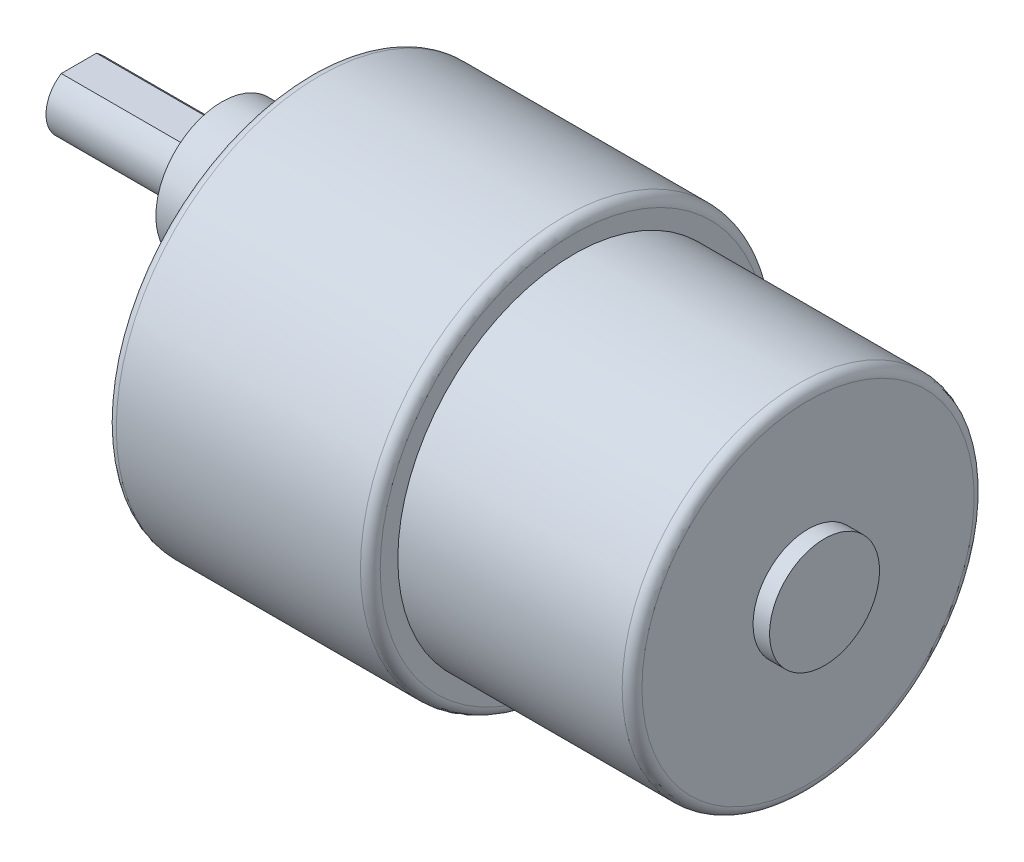
ISO-10303-21;
HEADER;
FILE_DESCRIPTION(('STEP AP214'),'2;1');
FILE_NAME('part.step','',(''),(''),'','','');
FILE_SCHEMA(('AUTOMOTIVE_DESIGN { 1 0 10303 214 1 1 1 1 }'));
ENDSEC;
DATA;
#1=APPLICATION_CONTEXT('core data for automotive mechanical design processes');
#2=APPLICATION_PROTOCOL_DEFINITION('international standard','automotive_design',2000,#1);
#3=PRODUCT_CONTEXT('',#1,'mechanical');
#4=PRODUCT('Part','Part','',(#3));
#5=PRODUCT_RELATED_PRODUCT_CATEGORY('part','',(#4));
#6=PRODUCT_DEFINITION_FORMATION('','',#4);
#7=PRODUCT_DEFINITION_CONTEXT('part definition',#1,'design');
#8=PRODUCT_DEFINITION('design','',#6,#7);
#9=PRODUCT_DEFINITION_SHAPE('','',#8);
#10=(LENGTH_UNIT() NAMED_UNIT(*) SI_UNIT(.MILLI.,.METRE.));
#11=(NAMED_UNIT(*) PLANE_ANGLE_UNIT() SI_UNIT($,.RADIAN.));
#12=(NAMED_UNIT(*) SI_UNIT($,.STERADIAN.) SOLID_ANGLE_UNIT());
#13=UNCERTAINTY_MEASURE_WITH_UNIT(LENGTH_MEASURE(1.E-05),#10,'distance_accuracy_value','');
#14=(GEOMETRIC_REPRESENTATION_CONTEXT(3) GLOBAL_UNCERTAINTY_ASSIGNED_CONTEXT((#13)) GLOBAL_UNIT_ASSIGNED_CONTEXT((#10,
#11,#12)) REPRESENTATION_CONTEXT('',''));
#15=CARTESIAN_POINT('',(0.,0.,0.));
#16=DIRECTION('',(0.,0.,1.));
#17=DIRECTION('',(1.,0.,0.));
#18=AXIS2_PLACEMENT_3D('',#15,#16,#17);
#19=CARTESIAN_POINT('',(-23.3,0.,0.));
#20=DIRECTION('',(1.,0.,0.));
#21=DIRECTION('',(0.,0.,-1.));
#22=AXIS2_PLACEMENT_3D('',#19,#20,#21);
#23=PLANE('',#22);
#24=CARTESIAN_POINT('',(-23.3,-13.4233937586587,7.75000000000016));
#25=DIRECTION('',(-1.,0.,0.));
#26=DIRECTION('',(0.,-0.866025403784433,0.50000000000001));
#27=AXIS2_PLACEMENT_3D('',#24,#25,#26);
#28=CIRCLE('',#27,0.749999999999973);
#29=CARTESIAN_POINT('',(-23.3,-14.072912811497,8.12500000000015));
#30=VERTEX_POINT('',#29);
#31=EDGE_CURVE('E274',#30,#30,#28,.T.);
#32=ORIENTED_EDGE('',*,*,#31,.F.);
#33=EDGE_LOOP('',(#32));
#34=FACE_BOUND('',#33,.T.);
#35=CARTESIAN_POINT('',(-23.3,-13.4233937586589,-7.74999999999987));
#36=DIRECTION('',(-1.,0.,0.));
#37=DIRECTION('',(0.,-0.866025403784443,-0.499999999999992));
#38=AXIS2_PLACEMENT_3D('',#35,#36,#37);
#39=CIRCLE('',#38,0.749999999999973);
#40=CARTESIAN_POINT('',(-23.3,-14.0729128114972,-8.12499999999986));
#41=VERTEX_POINT('',#40);
#42=EDGE_CURVE('E273',#41,#41,#39,.T.);
#43=ORIENTED_EDGE('',*,*,#42,.F.);
#44=EDGE_LOOP('',(#43));
#45=FACE_BOUND('',#44,.T.);
#46=CARTESIAN_POINT('',(-23.3,0.,-15.5));
#47=DIRECTION('',(-1.,0.,0.));
#48=DIRECTION('',(0.,0.,-1.));
#49=AXIS2_PLACEMENT_3D('',#46,#47,#48);
#50=CIRCLE('',#49,0.749999999999973);
#51=CARTESIAN_POINT('',(-23.3,0.,-16.25));
#52=VERTEX_POINT('',#51);
#53=EDGE_CURVE('E283',#52,#52,#50,.T.);
#54=ORIENTED_EDGE('',*,*,#53,.F.);
#55=EDGE_LOOP('',(#54));
#56=FACE_BOUND('',#55,.T.);
#57=CARTESIAN_POINT('',(-23.3,13.4233937586588,-7.75000000000006));
#58=DIRECTION('',(-1.,0.,0.));
#59=DIRECTION('',(0.,0.866025403784436,-0.500000000000004));
#60=AXIS2_PLACEMENT_3D('',#57,#58,#59);
#61=CIRCLE('',#60,0.749999999999973);
#62=CARTESIAN_POINT('',(-23.3,14.0729128114971,-8.12500000000005));
#63=VERTEX_POINT('',#62);
#64=EDGE_CURVE('E288',#63,#63,#61,.T.);
#65=ORIENTED_EDGE('',*,*,#64,.F.);
#66=EDGE_LOOP('',(#65));
#67=FACE_BOUND('',#66,.T.);
#68=CARTESIAN_POINT('',(-23.3,13.4233937586588,7.74999999999997));
#69=DIRECTION('',(-1.,0.,0.));
#70=DIRECTION('',(0.,0.86602540378444,0.499999999999998));
#71=AXIS2_PLACEMENT_3D('',#68,#69,#70);
#72=CIRCLE('',#71,0.749999999999973);
#73=CARTESIAN_POINT('',(-23.3,14.0729128114971,8.12499999999995));
#74=VERTEX_POINT('',#73);
#75=EDGE_CURVE('E294',#74,#74,#72,.T.);
#76=ORIENTED_EDGE('',*,*,#75,.F.);
#77=EDGE_LOOP('',(#76));
#78=FACE_BOUND('',#77,.T.);
#79=CARTESIAN_POINT('',(-23.3,0.,15.5));
#80=DIRECTION('',(-1.,0.,0.));
#81=DIRECTION('',(0.,0.,1.));
#82=AXIS2_PLACEMENT_3D('',#79,#80,#81);
#83=CIRCLE('',#82,0.749999999999973);
#84=CARTESIAN_POINT('',(-23.3,0.,16.25));
#85=VERTEX_POINT('',#84);
#86=EDGE_CURVE('E300',#85,#85,#83,.T.);
#87=ORIENTED_EDGE('',*,*,#86,.F.);
#88=EDGE_LOOP('',(#87));
#89=FACE_BOUND('',#88,.T.);
#90=CARTESIAN_POINT('',(-23.3,6.,0.));
#91=DIRECTION('',(1.,0.,0.));
#92=DIRECTION('',(0.,0.,-1.));
#93=AXIS2_PLACEMENT_3D('',#90,#91,#92);
#94=CIRCLE('',#93,6.);
#95=CARTESIAN_POINT('',(-23.3,6.,-6.));
#96=VERTEX_POINT('',#95);
#97=EDGE_CURVE('E11',#96,#96,#94,.F.);
#98=ORIENTED_EDGE('',*,*,#97,.F.);
#99=EDGE_LOOP('',(#98));
#100=FACE_BOUND('',#99,.T.);
#101=CARTESIAN_POINT('',(-23.3,0.,0.));
#102=DIRECTION('',(-1.,0.,0.));
#103=DIRECTION('',(0.,0.,1.));
#104=AXIS2_PLACEMENT_3D('',#101,#102,#103);
#105=CIRCLE('',#104,17.6);
#106=CARTESIAN_POINT('',(-23.3,0.,17.6));
#107=VERTEX_POINT('',#106);
#108=EDGE_CURVE('E132',#107,#107,#105,.T.);
#109=ORIENTED_EDGE('',*,*,#108,.T.);
#110=EDGE_LOOP('',(#109));
#111=FACE_BOUND('',#110,.T.);
#112=CARTESIAN_POINT('',(-23.3,6.,0.));
#113=DIRECTION('',(1.,0.,0.));
#114=DIRECTION('',(0.,0.,1.));
#115=AXIS2_PLACEMENT_3D('',#112,#113,#114);
#116=CIRCLE('',#115,8.);
#117=CARTESIAN_POINT('',(-23.3,9.66666666666667,7.11024300256718));
#118=VERTEX_POINT('',#117);
#119=CARTESIAN_POINT('',(-23.3,9.66666666666667,-7.11024300256718));
#120=VERTEX_POINT('',#119);
#121=EDGE_CURVE('E87',#118,#120,#116,.T.);
#122=ORIENTED_EDGE('',*,*,#121,.F.);
#123=CARTESIAN_POINT('',(-23.3,0.,0.));
#124=DIRECTION('',(-1.,0.,0.));
#125=DIRECTION('',(0.,0.,1.));
#126=AXIS2_PLACEMENT_3D('',#123,#124,#125);
#127=CIRCLE('',#126,12.);
#128=EDGE_CURVE('E48',#120,#118,#127,.T.);
#129=ORIENTED_EDGE('',*,*,#128,.F.);
#130=EDGE_LOOP('',(#122,#129));
#131=FACE_BOUND('',#130,.T.);
#132=ADVANCED_FACE('F33',(#34,#45,#56,#67,#78,#89,#100,#111,#131),#23,.F.);
#133=CARTESIAN_POINT('',(21.1,0.,0.));
#134=DIRECTION('',(-1.,0.,0.));
#135=DIRECTION('',(0.,0.,1.));
#136=AXIS2_PLACEMENT_3D('',#133,#134,#135);
#137=TOROIDAL_SURFACE('',#136,15.1,0.899999999999999);
#138=CARTESIAN_POINT('',(21.1,0.,0.));
#139=DIRECTION('',(-1.,0.,0.));
#140=DIRECTION('',(0.,0.,1.));
#141=AXIS2_PLACEMENT_3D('',#138,#139,#140);
#142=CIRCLE('',#141,16.);
#143=CARTESIAN_POINT('',(21.1,0.,16.));
#144=VERTEX_POINT('',#143);
#145=EDGE_CURVE('E117',#144,#144,#142,.T.);
#146=ORIENTED_EDGE('',*,*,#145,.F.);
#147=EDGE_LOOP('',(#146));
#148=FACE_BOUND('',#147,.T.);
#149=CARTESIAN_POINT('',(22.,0.,0.));
#150=DIRECTION('',(-1.,0.,0.));
#151=DIRECTION('',(0.,0.,1.));
#152=AXIS2_PLACEMENT_3D('',#149,#150,#151);
#153=CIRCLE('',#152,15.1);
#154=CARTESIAN_POINT('',(22.,0.,15.1));
#155=VERTEX_POINT('',#154);
#156=EDGE_CURVE('E41',#155,#155,#153,.T.);
#157=ORIENTED_EDGE('',*,*,#156,.T.);
#158=EDGE_LOOP('',(#157));
#159=FACE_BOUND('',#158,.T.);
#160=ADVANCED_FACE('F35',(#148,#159),#137,.T.);
#161=CARTESIAN_POINT('',(22.,0.,-15.1));
#162=DIRECTION('',(-1.,0.,0.));
#163=DIRECTION('',(0.,0.,1.));
#164=AXIS2_PLACEMENT_3D('',#161,#162,#163);
#165=PLANE('',#164);
#166=ORIENTED_EDGE('',*,*,#156,.F.);
#167=EDGE_LOOP('',(#166));
#168=FACE_BOUND('',#167,.T.);
#169=CARTESIAN_POINT('',(22.,0.,0.));
#170=DIRECTION('',(-1.,0.,0.));
#171=DIRECTION('',(0.,0.,1.));
#172=AXIS2_PLACEMENT_3D('',#169,#170,#171);
#173=CIRCLE('',#172,5.);
#174=CARTESIAN_POINT('',(22.,0.,5.));
#175=VERTEX_POINT('',#174);
#176=EDGE_CURVE('E138',#175,#175,#173,.T.);
#177=ORIENTED_EDGE('',*,*,#176,.T.);
#178=EDGE_LOOP('',(#177));
#179=FACE_BOUND('',#178,.T.);
#180=ADVANCED_FACE('F144',(#168,#179),#165,.F.);
#181=CARTESIAN_POINT('',(-35.5466518271193,0.,0.));
#182=DIRECTION('',(-1.,0.,0.));
#183=DIRECTION('',(0.,0.,1.));
#184=AXIS2_PLACEMENT_3D('',#181,#182,#183);
#185=CYLINDRICAL_SURFACE('',#184,5.);
#186=ORIENTED_EDGE('',*,*,#176,.F.);
#187=EDGE_LOOP('',(#186));
#188=FACE_BOUND('',#187,.T.);
#189=CARTESIAN_POINT('',(23.5,0.,0.));
#190=DIRECTION('',(-1.,0.,0.));
#191=DIRECTION('',(0.,0.,1.));
#192=AXIS2_PLACEMENT_3D('',#189,#190,#191);
#193=CIRCLE('',#192,5.);
#194=CARTESIAN_POINT('',(23.5,0.,5.));
#195=VERTEX_POINT('',#194);
#196=EDGE_CURVE('E135',#195,#195,#193,.T.);
#197=ORIENTED_EDGE('',*,*,#196,.T.);
#198=EDGE_LOOP('',(#197));
#199=FACE_BOUND('',#198,.T.);
#200=ADVANCED_FACE('F147',(#188,#199),#185,.T.);
#201=CARTESIAN_POINT('',(23.5,0.,-5.));
#202=DIRECTION('',(-1.,0.,0.));
#203=DIRECTION('',(0.,0.,1.));
#204=AXIS2_PLACEMENT_3D('',#201,#202,#203);
#205=PLANE('',#204);
#206=ORIENTED_EDGE('',*,*,#196,.F.);
#207=EDGE_LOOP('',(#206));
#208=FACE_BOUND('',#207,.T.);
#209=ADVANCED_FACE('F152',(#208),#205,.F.);
#210=CARTESIAN_POINT('',(-22.4,0.,0.));
#211=DIRECTION('',(-1.,0.,0.));
#212=DIRECTION('',(0.,0.,1.));
#213=AXIS2_PLACEMENT_3D('',#210,#211,#212);
#214=TOROIDAL_SURFACE('',#213,17.6,0.900000000000001);
#215=ORIENTED_EDGE('',*,*,#108,.F.);
#216=EDGE_LOOP('',(#215));
#217=FACE_BOUND('',#216,.T.);
#218=CARTESIAN_POINT('',(-22.4,0.,0.));
#219=DIRECTION('',(-1.,0.,0.));
#220=DIRECTION('',(0.,0.,1.));
#221=AXIS2_PLACEMENT_3D('',#218,#219,#220);
#222=CIRCLE('',#221,18.5);
#223=CARTESIAN_POINT('',(-22.4,0.,18.5));
#224=VERTEX_POINT('',#223);
#225=EDGE_CURVE('E129',#224,#224,#222,.T.);
#226=ORIENTED_EDGE('',*,*,#225,.T.);
#227=EDGE_LOOP('',(#226));
#228=FACE_BOUND('',#227,.T.);
#229=ADVANCED_FACE('F157',(#217,#228),#214,.T.);
#230=CARTESIAN_POINT('',(-35.5466518271193,0.,0.));
#231=DIRECTION('',(-1.,0.,0.));
#232=DIRECTION('',(0.,0.,1.));
#233=AXIS2_PLACEMENT_3D('',#230,#231,#232);
#234=CYLINDRICAL_SURFACE('',#233,18.5);
#235=ORIENTED_EDGE('',*,*,#225,.F.);
#236=EDGE_LOOP('',(#235));
#237=FACE_BOUND('',#236,.T.);
#238=CARTESIAN_POINT('',(-0.200000000000006,0.,0.));
#239=DIRECTION('',(-1.,0.,0.));
#240=DIRECTION('',(0.,0.,1.));
#241=AXIS2_PLACEMENT_3D('',#238,#239,#240);
#242=CIRCLE('',#241,18.5);
#243=CARTESIAN_POINT('',(-0.200000000000006,0.,18.5));
#244=VERTEX_POINT('',#243);
#245=EDGE_CURVE('E126',#244,#244,#242,.T.);
#246=ORIENTED_EDGE('',*,*,#245,.T.);
#247=EDGE_LOOP('',(#246));
#248=FACE_BOUND('',#247,.T.);
#249=ADVANCED_FACE('F162',(#237,#248),#234,.T.);
#250=CARTESIAN_POINT('',(-0.200000000000005,0.,0.));
#251=DIRECTION('',(-1.,0.,0.));
#252=DIRECTION('',(0.,0.,1.));
#253=AXIS2_PLACEMENT_3D('',#250,#251,#252);
#254=TOROIDAL_SURFACE('',#253,17.6,0.899999999999999);
#255=ORIENTED_EDGE('',*,*,#245,.F.);
#256=EDGE_LOOP('',(#255));
#257=FACE_BOUND('',#256,.T.);
#258=CARTESIAN_POINT('',(0.699999999999992,0.,0.));
#259=DIRECTION('',(-1.,0.,0.));
#260=DIRECTION('',(0.,0.,1.));
#261=AXIS2_PLACEMENT_3D('',#258,#259,#260);
#262=CIRCLE('',#261,17.6);
#263=CARTESIAN_POINT('',(0.699999999999992,0.,17.6));
#264=VERTEX_POINT('',#263);
#265=EDGE_CURVE('E123',#264,#264,#262,.T.);
#266=ORIENTED_EDGE('',*,*,#265,.T.);
#267=EDGE_LOOP('',(#266));
#268=FACE_BOUND('',#267,.T.);
#269=ADVANCED_FACE('F179',(#257,#268),#254,.T.);
#270=CARTESIAN_POINT('',(0.699999999999996,0.,-17.6));
#271=DIRECTION('',(-1.,0.,0.));
#272=DIRECTION('',(0.,0.,1.));
#273=AXIS2_PLACEMENT_3D('',#270,#271,#272);
#274=PLANE('',#273);
#275=ORIENTED_EDGE('',*,*,#265,.F.);
#276=EDGE_LOOP('',(#275));
#277=FACE_BOUND('',#276,.T.);
#278=CARTESIAN_POINT('',(0.699999999999992,0.,0.));
#279=DIRECTION('',(-1.,0.,0.));
#280=DIRECTION('',(0.,0.,1.));
#281=AXIS2_PLACEMENT_3D('',#278,#279,#280);
#282=CIRCLE('',#281,16.);
#283=CARTESIAN_POINT('',(0.699999999999992,0.,16.));
#284=VERTEX_POINT('',#283);
#285=EDGE_CURVE('E120',#284,#284,#282,.T.);
#286=ORIENTED_EDGE('',*,*,#285,.T.);
#287=EDGE_LOOP('',(#286));
#288=FACE_BOUND('',#287,.T.);
#289=ADVANCED_FACE('F183',(#277,#288),#274,.F.);
#290=CARTESIAN_POINT('',(-35.5466518271193,0.,0.));
#291=DIRECTION('',(-1.,0.,0.));
#292=DIRECTION('',(0.,0.,1.));
#293=AXIS2_PLACEMENT_3D('',#290,#291,#292);
#294=CYLINDRICAL_SURFACE('',#293,16.);
#295=ORIENTED_EDGE('',*,*,#285,.F.);
#296=EDGE_LOOP('',(#295));
#297=FACE_BOUND('',#296,.T.);
#298=ORIENTED_EDGE('',*,*,#145,.T.);
#299=EDGE_LOOP('',(#298));
#300=FACE_BOUND('',#299,.T.);
#301=ADVANCED_FACE('F187',(#297,#300),#294,.T.);
#302=CARTESIAN_POINT('',(-31.3,6.,0.));
#303=DIRECTION('',(1.,0.,0.));
#304=DIRECTION('',(0.,0.,-1.));
#305=AXIS2_PLACEMENT_3D('',#302,#303,#304);
#306=CYLINDRICAL_SURFACE('',#305,6.);
#307=CARTESIAN_POINT('',(-31.3,6.,0.));
#308=DIRECTION('',(-1.,0.,0.));
#309=DIRECTION('',(0.,0.,1.));
#310=AXIS2_PLACEMENT_3D('',#307,#308,#309);
#311=CIRCLE('',#310,6.);
#312=CARTESIAN_POINT('',(-31.3,6.,6.));
#313=VERTEX_POINT('',#312);
#314=EDGE_CURVE('E112',#313,#313,#311,.T.);
#315=ORIENTED_EDGE('',*,*,#314,.F.);
#316=EDGE_LOOP('',(#315));
#317=FACE_BOUND('',#316,.T.);
#318=ORIENTED_EDGE('',*,*,#97,.T.);
#319=EDGE_LOOP('',(#318));
#320=FACE_BOUND('',#319,.T.);
#321=ADVANCED_FACE('F191',(#317,#320),#306,.T.);
#322=CARTESIAN_POINT('',(-31.3,6.,0.));
#323=DIRECTION('',(-1.,0.,0.));
#324=DIRECTION('',(0.,0.,1.));
#325=AXIS2_PLACEMENT_3D('',#322,#323,#324);
#326=PLANE('',#325);
#327=CARTESIAN_POINT('',(-31.3,6.,0.));
#328=DIRECTION('',(-1.,0.,0.));
#329=DIRECTION('',(0.,0.,1.));
#330=AXIS2_PLACEMENT_3D('',#327,#328,#329);
#331=CIRCLE('',#330,2.99042236103044);
#332=CARTESIAN_POINT('',(-31.3,6.,2.99042236103044));
#333=VERTEX_POINT('',#332);
#334=EDGE_CURVE('E107',#333,#333,#331,.T.);
#335=ORIENTED_EDGE('',*,*,#334,.F.);
#336=EDGE_LOOP('',(#335));
#337=FACE_BOUND('',#336,.T.);
#338=ORIENTED_EDGE('',*,*,#314,.T.);
#339=EDGE_LOOP('',(#338));
#340=FACE_BOUND('',#339,.T.);
#341=ADVANCED_FACE('F195',(#337,#340),#326,.T.);
#342=CARTESIAN_POINT('',(-44.3,6.,0.));
#343=DIRECTION('',(1.,0.,0.));
#344=DIRECTION('',(0.,0.,-1.));
#345=AXIS2_PLACEMENT_3D('',#342,#343,#344);
#346=CYLINDRICAL_SURFACE('',#345,2.99042236103044);
#347=CARTESIAN_POINT('',(-44.3,6.,0.));
#348=DIRECTION('',(-1.,0.,0.));
#349=DIRECTION('',(0.,0.,1.));
#350=AXIS2_PLACEMENT_3D('',#347,#348,#349);
#351=CIRCLE('',#350,2.99042236103044);
#352=CARTESIAN_POINT('',(-44.3,8.52638593594701,-1.6));
#353=VERTEX_POINT('',#352);
#354=CARTESIAN_POINT('',(-44.3,8.52638593594701,1.6));
#355=VERTEX_POINT('',#354);
#356=EDGE_CURVE('E109',#353,#355,#351,.T.);
#357=ORIENTED_EDGE('',*,*,#356,.F.);
#358=DIRECTION('',(-1.,0.,0.));
#359=VECTOR('',#358,1.);
#360=CARTESIAN_POINT('',(-33.3,8.52638593594701,-1.6));
#361=LINE('',#360,#359);
#362=CARTESIAN_POINT('',(-33.3,8.52638593594701,-1.6));
#363=VERTEX_POINT('',#362);
#364=EDGE_CURVE('E56',#363,#353,#361,.T.);
#365=ORIENTED_EDGE('',*,*,#364,.F.);
#366=CARTESIAN_POINT('',(-33.3,6.,0.));
#367=DIRECTION('',(-1.,0.,0.));
#368=DIRECTION('',(0.,0.,1.));
#369=AXIS2_PLACEMENT_3D('',#366,#367,#368);
#370=CIRCLE('',#369,2.99042236103044);
#371=CARTESIAN_POINT('',(-33.3,8.52638593594701,1.6));
#372=VERTEX_POINT('',#371);
#373=EDGE_CURVE('E98',#372,#363,#370,.T.);
#374=ORIENTED_EDGE('',*,*,#373,.F.);
#375=DIRECTION('',(-1.,0.,0.));
#376=VECTOR('',#375,1.);
#377=CARTESIAN_POINT('',(-33.3,8.52638593594701,1.6));
#378=LINE('',#377,#376);
#379=EDGE_CURVE('E104',#372,#355,#378,.T.);
#380=ORIENTED_EDGE('',*,*,#379,.T.);
#381=EDGE_LOOP('',(#357,#365,#374,#380));
#382=FACE_BOUND('',#381,.T.);
#383=ORIENTED_EDGE('',*,*,#334,.T.);
#384=EDGE_LOOP('',(#383));
#385=FACE_BOUND('',#384,.T.);
#386=ADVANCED_FACE('F199',(#382,#385),#346,.T.);
#387=CARTESIAN_POINT('',(-44.3,6.,0.));
#388=DIRECTION('',(-1.,0.,0.));
#389=DIRECTION('',(0.,0.,1.));
#390=AXIS2_PLACEMENT_3D('',#387,#388,#389);
#391=PLANE('',#390);
#392=DIRECTION('',(0.,0.,1.));
#393=VECTOR('',#392,1.);
#394=CARTESIAN_POINT('',(-44.3,8.52638593594701,-1.6));
#395=LINE('',#394,#393);
#396=EDGE_CURVE('E96',#353,#355,#395,.T.);
#397=ORIENTED_EDGE('',*,*,#396,.F.);
#398=ORIENTED_EDGE('',*,*,#356,.T.);
#399=EDGE_LOOP('',(#397,#398));
#400=FACE_BOUND('',#399,.T.);
#401=ADVANCED_FACE('F203',(#400),#391,.T.);
#402=CARTESIAN_POINT('',(-33.3,8.52638593594701,-1.6));
#403=DIRECTION('',(0.,-1.,0.));
#404=DIRECTION('',(0.,0.,-1.));
#405=AXIS2_PLACEMENT_3D('',#402,#403,#404);
#406=PLANE('',#405);
#407=ORIENTED_EDGE('',*,*,#396,.T.);
#408=ORIENTED_EDGE('',*,*,#379,.F.);
#409=DIRECTION('',(0.,0.,1.));
#410=VECTOR('',#409,1.);
#411=CARTESIAN_POINT('',(-33.3,8.52638593594701,-1.6));
#412=LINE('',#411,#410);
#413=EDGE_CURVE('E100',#363,#372,#412,.T.);
#414=ORIENTED_EDGE('',*,*,#413,.F.);
#415=ORIENTED_EDGE('',*,*,#364,.T.);
#416=EDGE_LOOP('',(#407,#408,#414,#415));
#417=FACE_BOUND('',#416,.T.);
#418=ADVANCED_FACE('F207',(#417),#406,.F.);
#419=CARTESIAN_POINT('',(-33.3,6.,0.));
#420=DIRECTION('',(-1.,0.,0.));
#421=DIRECTION('',(0.,0.,1.));
#422=AXIS2_PLACEMENT_3D('',#419,#420,#421);
#423=PLANE('',#422);
#424=ORIENTED_EDGE('',*,*,#373,.T.);
#425=ORIENTED_EDGE('',*,*,#413,.T.);
#426=EDGE_LOOP('',(#424,#425));
#427=FACE_BOUND('',#426,.T.);
#428=ADVANCED_FACE('F211',(#427),#423,.T.);
#429=CARTESIAN_POINT('',(-22.3,0.,0.));
#430=DIRECTION('',(-1.,0.,0.));
#431=DIRECTION('',(0.,0.,1.));
#432=AXIS2_PLACEMENT_3D('',#429,#430,#431);
#433=CYLINDRICAL_SURFACE('',#432,12.);
#434=ORIENTED_EDGE('',*,*,#128,.T.);
#435=DIRECTION('',(-1.,0.,0.));
#436=VECTOR('',#435,1.);
#437=CARTESIAN_POINT('',(-22.3,9.66666666666667,7.11024300256718));
#438=LINE('',#437,#436);
#439=CARTESIAN_POINT('',(-22.3,9.66666666666667,7.11024300256718));
#440=VERTEX_POINT('',#439);
#441=EDGE_CURVE('E73',#440,#118,#438,.T.);
#442=ORIENTED_EDGE('',*,*,#441,.F.);
#443=CARTESIAN_POINT('',(-22.3,0.,0.));
#444=DIRECTION('',(-1.,0.,0.));
#445=DIRECTION('',(0.,0.,1.));
#446=AXIS2_PLACEMENT_3D('',#443,#444,#445);
#447=CIRCLE('',#446,12.);
#448=CARTESIAN_POINT('',(-22.3,9.66666666666667,-7.11024300256718));
#449=VERTEX_POINT('',#448);
#450=EDGE_CURVE('E76',#449,#440,#447,.T.);
#451=ORIENTED_EDGE('',*,*,#450,.F.);
#452=DIRECTION('',(-1.,0.,0.));
#453=VECTOR('',#452,1.);
#454=CARTESIAN_POINT('',(-22.3,9.66666666666667,-7.11024300256718));
#455=LINE('',#454,#453);
#456=EDGE_CURVE('E82',#449,#120,#455,.T.);
#457=ORIENTED_EDGE('',*,*,#456,.T.);
#458=EDGE_LOOP('',(#434,#442,#451,#457));
#459=FACE_BOUND('',#458,.T.);
#460=ADVANCED_FACE('F75',(#459),#433,.F.);
#461=CARTESIAN_POINT('',(-22.3,6.,0.));
#462=DIRECTION('',(-1.,0.,0.));
#463=DIRECTION('',(0.,0.,1.));
#464=AXIS2_PLACEMENT_3D('',#461,#462,#463);
#465=CYLINDRICAL_SURFACE('',#464,8.);
#466=ORIENTED_EDGE('',*,*,#121,.T.);
#467=ORIENTED_EDGE('',*,*,#456,.F.);
#468=CARTESIAN_POINT('',(-22.3,6.,0.));
#469=DIRECTION('',(1.,0.,0.));
#470=DIRECTION('',(0.,0.,1.));
#471=AXIS2_PLACEMENT_3D('',#468,#469,#470);
#472=CIRCLE('',#471,8.);
#473=EDGE_CURVE('E83',#440,#449,#472,.T.);
#474=ORIENTED_EDGE('',*,*,#473,.F.);
#475=ORIENTED_EDGE('',*,*,#441,.T.);
#476=EDGE_LOOP('',(#466,#467,#474,#475));
#477=FACE_BOUND('',#476,.T.);
#478=ADVANCED_FACE('F89',(#477),#465,.T.);
#479=CARTESIAN_POINT('',(-22.3,3.,0.));
#480=DIRECTION('',(-1.,0.,0.));
#481=DIRECTION('',(0.,0.,1.));
#482=AXIS2_PLACEMENT_3D('',#479,#480,#481);
#483=PLANE('',#482);
#484=ORIENTED_EDGE('',*,*,#450,.T.);
#485=ORIENTED_EDGE('',*,*,#473,.T.);
#486=EDGE_LOOP('',(#484,#485));
#487=FACE_BOUND('',#486,.T.);
#488=ADVANCED_FACE('F86',(#487),#483,.T.);
#489=CARTESIAN_POINT('',(-21.3,0.,15.5));
#490=DIRECTION('',(-1.,0.,0.));
#491=DIRECTION('',(0.,0.,1.));
#492=AXIS2_PLACEMENT_3D('',#489,#490,#491);
#493=CYLINDRICAL_SURFACE('',#492,0.749999999999973);
#494=CARTESIAN_POINT('',(-21.3,0.,15.5));
#495=DIRECTION('',(-1.,0.,0.));
#496=DIRECTION('',(0.,0.,1.));
#497=AXIS2_PLACEMENT_3D('',#494,#495,#496);
#498=CIRCLE('',#497,0.749999999999973);
#499=CARTESIAN_POINT('',(-21.3,0.,16.25));
#500=VERTEX_POINT('',#499);
#501=EDGE_CURVE('E94',#500,#500,#498,.T.);
#502=ORIENTED_EDGE('',*,*,#501,.F.);
#503=EDGE_LOOP('',(#502));
#504=FACE_BOUND('',#503,.T.);
#505=ORIENTED_EDGE('',*,*,#86,.T.);
#506=EDGE_LOOP('',(#505));
#507=FACE_BOUND('',#506,.T.);
#508=ADVANCED_FACE('F221',(#504,#507),#493,.F.);
#509=CARTESIAN_POINT('',(-21.3,0.,15.5));
#510=DIRECTION('',(-1.,0.,0.));
#511=DIRECTION('',(0.,0.,1.));
#512=AXIS2_PLACEMENT_3D('',#509,#510,#511);
#513=PLANE('',#512);
#514=ORIENTED_EDGE('',*,*,#501,.T.);
#515=EDGE_LOOP('',(#514));
#516=FACE_BOUND('',#515,.T.);
#517=ADVANCED_FACE('F224',(#516),#513,.T.);
#518=CARTESIAN_POINT('',(-21.3,13.4233937586588,7.74999999999997));
#519=DIRECTION('',(-1.,0.,0.));
#520=DIRECTION('',(0.,0.,1.));
#521=AXIS2_PLACEMENT_3D('',#518,#519,#520);
#522=CYLINDRICAL_SURFACE('',#521,0.749999999999973);
#523=CARTESIAN_POINT('',(-21.3,13.4233937586588,7.74999999999997));
#524=DIRECTION('',(-1.,0.,0.));
#525=DIRECTION('',(0.,0.86602540378444,0.499999999999998));
#526=AXIS2_PLACEMENT_3D('',#523,#524,#525);
#527=CIRCLE('',#526,0.749999999999973);
#528=CARTESIAN_POINT('',(-21.3,14.0729128114971,8.12499999999995));
#529=VERTEX_POINT('',#528);
#530=EDGE_CURVE('E297',#529,#529,#527,.T.);
#531=ORIENTED_EDGE('',*,*,#530,.F.);
#532=EDGE_LOOP('',(#531));
#533=FACE_BOUND('',#532,.T.);
#534=ORIENTED_EDGE('',*,*,#75,.T.);
#535=EDGE_LOOP('',(#534));
#536=FACE_BOUND('',#535,.T.);
#537=ADVANCED_FACE('F228',(#533,#536),#522,.F.);
#538=CARTESIAN_POINT('',(-21.3,13.4233937586588,7.74999999999997));
#539=DIRECTION('',(-1.,0.,0.));
#540=DIRECTION('',(0.,0.86602540378444,0.499999999999998));
#541=AXIS2_PLACEMENT_3D('',#538,#539,#540);
#542=PLANE('',#541);
#543=ORIENTED_EDGE('',*,*,#530,.T.);
#544=EDGE_LOOP('',(#543));
#545=FACE_BOUND('',#544,.T.);
#546=ADVANCED_FACE('F232',(#545),#542,.T.);
#547=CARTESIAN_POINT('',(-21.3,13.4233937586588,-7.75000000000006));
#548=DIRECTION('',(-1.,0.,0.));
#549=DIRECTION('',(0.,0.,1.));
#550=AXIS2_PLACEMENT_3D('',#547,#548,#549);
#551=CYLINDRICAL_SURFACE('',#550,0.749999999999973);
#552=CARTESIAN_POINT('',(-21.3,13.4233937586588,-7.75000000000006));
#553=DIRECTION('',(-1.,0.,0.));
#554=DIRECTION('',(0.,0.866025403784436,-0.500000000000004));
#555=AXIS2_PLACEMENT_3D('',#552,#553,#554);
#556=CIRCLE('',#555,0.749999999999973);
#557=CARTESIAN_POINT('',(-21.3,14.0729128114971,-8.12500000000005));
#558=VERTEX_POINT('',#557);
#559=EDGE_CURVE('E291',#558,#558,#556,.T.);
#560=ORIENTED_EDGE('',*,*,#559,.F.);
#561=EDGE_LOOP('',(#560));
#562=FACE_BOUND('',#561,.T.);
#563=ORIENTED_EDGE('',*,*,#64,.T.);
#564=EDGE_LOOP('',(#563));
#565=FACE_BOUND('',#564,.T.);
#566=ADVANCED_FACE('F236',(#562,#565),#551,.F.);
#567=CARTESIAN_POINT('',(-21.3,13.4233937586588,-7.75000000000006));
#568=DIRECTION('',(-1.,0.,0.));
#569=DIRECTION('',(0.,0.866025403784436,-0.500000000000004));
#570=AXIS2_PLACEMENT_3D('',#567,#568,#569);
#571=PLANE('',#570);
#572=ORIENTED_EDGE('',*,*,#559,.T.);
#573=EDGE_LOOP('',(#572));
#574=FACE_BOUND('',#573,.T.);
#575=ADVANCED_FACE('F240',(#574),#571,.T.);
#576=CARTESIAN_POINT('',(-21.3,0.,-15.5));
#577=DIRECTION('',(-1.,0.,0.));
#578=DIRECTION('',(0.,0.,1.));
#579=AXIS2_PLACEMENT_3D('',#576,#577,#578);
#580=CYLINDRICAL_SURFACE('',#579,0.749999999999973);
#581=CARTESIAN_POINT('',(-21.3,0.,-15.5));
#582=DIRECTION('',(-1.,0.,0.));
#583=DIRECTION('',(0.,0.,-1.));
#584=AXIS2_PLACEMENT_3D('',#581,#582,#583);
#585=CIRCLE('',#584,0.749999999999973);
#586=CARTESIAN_POINT('',(-21.3,0.,-16.25));
#587=VERTEX_POINT('',#586);
#588=EDGE_CURVE('E285',#587,#587,#585,.T.);
#589=ORIENTED_EDGE('',*,*,#588,.F.);
#590=EDGE_LOOP('',(#589));
#591=FACE_BOUND('',#590,.T.);
#592=ORIENTED_EDGE('',*,*,#53,.T.);
#593=EDGE_LOOP('',(#592));
#594=FACE_BOUND('',#593,.T.);
#595=ADVANCED_FACE('F244',(#591,#594),#580,.F.);
#596=CARTESIAN_POINT('',(-21.3,0.,-15.5));
#597=DIRECTION('',(-1.,0.,0.));
#598=DIRECTION('',(0.,0.,-1.));
#599=AXIS2_PLACEMENT_3D('',#596,#597,#598);
#600=PLANE('',#599);
#601=ORIENTED_EDGE('',*,*,#588,.T.);
#602=EDGE_LOOP('',(#601));
#603=FACE_BOUND('',#602,.T.);
#604=ADVANCED_FACE('F248',(#603),#600,.T.);
#605=CARTESIAN_POINT('',(-21.3,-13.4233937586589,-7.74999999999987));
#606=DIRECTION('',(-1.,0.,0.));
#607=DIRECTION('',(0.,0.,1.));
#608=AXIS2_PLACEMENT_3D('',#605,#606,#607);
#609=CYLINDRICAL_SURFACE('',#608,0.749999999999973);
#610=CARTESIAN_POINT('',(-21.3,-13.4233937586589,-7.74999999999987));
#611=DIRECTION('',(-1.,0.,0.));
#612=DIRECTION('',(0.,-0.866025403784443,-0.499999999999992));
#613=AXIS2_PLACEMENT_3D('',#610,#611,#612);
#614=CIRCLE('',#613,0.749999999999973);
#615=CARTESIAN_POINT('',(-21.3,-14.0729128114972,-8.12499999999986));
#616=VERTEX_POINT('',#615);
#617=EDGE_CURVE('E277',#616,#616,#614,.T.);
#618=ORIENTED_EDGE('',*,*,#617,.F.);
#619=EDGE_LOOP('',(#618));
#620=FACE_BOUND('',#619,.T.);
#621=ORIENTED_EDGE('',*,*,#42,.T.);
#622=EDGE_LOOP('',(#621));
#623=FACE_BOUND('',#622,.T.);
#624=ADVANCED_FACE('F252',(#620,#623),#609,.F.);
#625=CARTESIAN_POINT('',(-21.3,-13.4233937586589,-7.74999999999987));
#626=DIRECTION('',(-1.,0.,0.));
#627=DIRECTION('',(0.,-0.866025403784443,-0.499999999999992));
#628=AXIS2_PLACEMENT_3D('',#625,#626,#627);
#629=PLANE('',#628);
#630=ORIENTED_EDGE('',*,*,#617,.T.);
#631=EDGE_LOOP('',(#630));
#632=FACE_BOUND('',#631,.T.);
#633=ADVANCED_FACE('F256',(#632),#629,.T.);
#634=CARTESIAN_POINT('',(-21.3,-13.4233937586587,7.75000000000016));
#635=DIRECTION('',(-1.,0.,0.));
#636=DIRECTION('',(0.,0.,1.));
#637=AXIS2_PLACEMENT_3D('',#634,#635,#636);
#638=CYLINDRICAL_SURFACE('',#637,0.749999999999973);
#639=CARTESIAN_POINT('',(-21.3,-13.4233937586587,7.75000000000016));
#640=DIRECTION('',(-1.,0.,0.));
#641=DIRECTION('',(0.,-0.866025403784433,0.50000000000001));
#642=AXIS2_PLACEMENT_3D('',#639,#640,#641);
#643=CIRCLE('',#642,0.749999999999973);
#644=CARTESIAN_POINT('',(-21.3,-14.072912811497,8.12500000000015));
#645=VERTEX_POINT('',#644);
#646=EDGE_CURVE('E272',#645,#645,#643,.T.);
#647=ORIENTED_EDGE('',*,*,#646,.F.);
#648=EDGE_LOOP('',(#647));
#649=FACE_BOUND('',#648,.T.);
#650=ORIENTED_EDGE('',*,*,#31,.T.);
#651=EDGE_LOOP('',(#650));
#652=FACE_BOUND('',#651,.T.);
#653=ADVANCED_FACE('F260',(#649,#652),#638,.F.);
#654=CARTESIAN_POINT('',(-21.3,-13.4233937586587,7.75000000000016));
#655=DIRECTION('',(-1.,0.,0.));
#656=DIRECTION('',(0.,-0.866025403784433,0.50000000000001));
#657=AXIS2_PLACEMENT_3D('',#654,#655,#656);
#658=PLANE('',#657);
#659=ORIENTED_EDGE('',*,*,#646,.T.);
#660=EDGE_LOOP('',(#659));
#661=FACE_BOUND('',#660,.T.);
#662=ADVANCED_FACE('F264',(#661),#658,.T.);
#663=CLOSED_SHELL('',(#132,#160,#180,#200,#209,#229,#249,#269,#289,#301,#321,#341,#386,#401,
#418,#428,#460,#478,#488,#508,#517,#537,#546,#566,#575,#595,#604,#624,#633,#653,#662));
#664=MANIFOLD_SOLID_BREP('B2',#663);
#665=ADVANCED_BREP_SHAPE_REPRESENTATION('',(#18,#664),#14);
#666=SHAPE_DEFINITION_REPRESENTATION(#9,#665);
ENDSEC;
END-ISO-10303-21;
